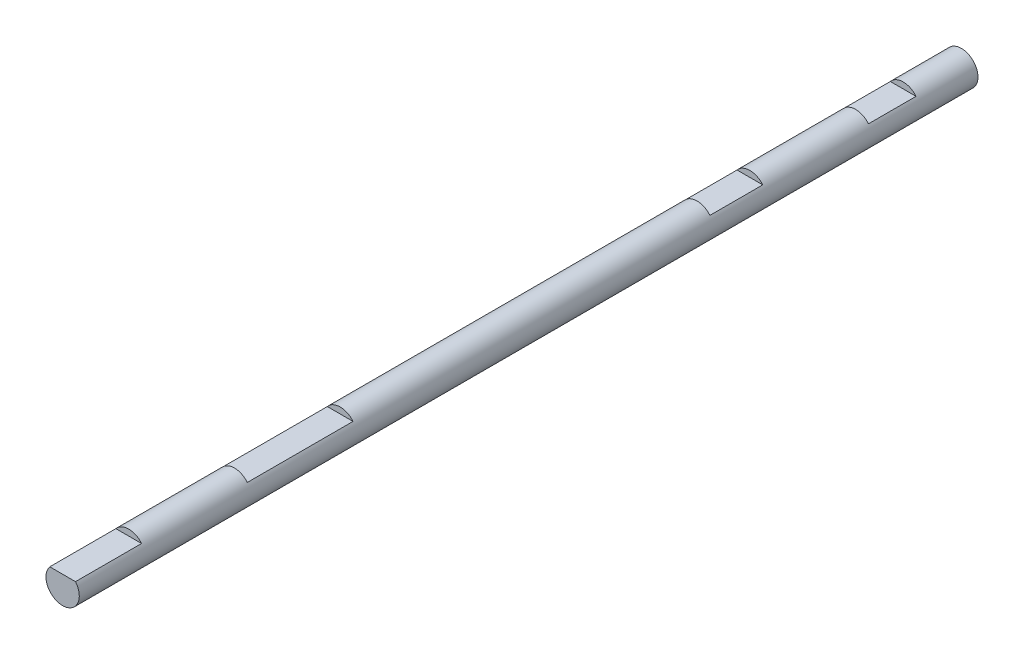
ISO-10303-21;
HEADER;
FILE_DESCRIPTION(('STEP AP214'),'2;1');
FILE_NAME('part.step','',(''),(''),'','','');
FILE_SCHEMA(('AUTOMOTIVE_DESIGN { 1 0 10303 214 1 1 1 1 }'));
ENDSEC;
DATA;
#1=APPLICATION_CONTEXT('core data for automotive mechanical design processes');
#2=APPLICATION_PROTOCOL_DEFINITION('international standard','automotive_design',2000,#1);
#3=PRODUCT_CONTEXT('',#1,'mechanical');
#4=PRODUCT('Part','Part','',(#3));
#5=PRODUCT_RELATED_PRODUCT_CATEGORY('part','',(#4));
#6=PRODUCT_DEFINITION_FORMATION('','',#4);
#7=PRODUCT_DEFINITION_CONTEXT('part definition',#1,'design');
#8=PRODUCT_DEFINITION('design','',#6,#7);
#9=PRODUCT_DEFINITION_SHAPE('','',#8);
#10=(LENGTH_UNIT() NAMED_UNIT(*) SI_UNIT(.MILLI.,.METRE.));
#11=(NAMED_UNIT(*) PLANE_ANGLE_UNIT() SI_UNIT($,.RADIAN.));
#12=(NAMED_UNIT(*) SI_UNIT($,.STERADIAN.) SOLID_ANGLE_UNIT());
#13=UNCERTAINTY_MEASURE_WITH_UNIT(LENGTH_MEASURE(1.E-05),#10,'distance_accuracy_value','');
#14=(GEOMETRIC_REPRESENTATION_CONTEXT(3) GLOBAL_UNCERTAINTY_ASSIGNED_CONTEXT((#13)) GLOBAL_UNIT_ASSIGNED_CONTEXT((#10,
#11,#12)) REPRESENTATION_CONTEXT('',''));
#15=CARTESIAN_POINT('',(0.,0.,0.));
#16=DIRECTION('',(0.,0.,1.));
#17=DIRECTION('',(1.,0.,0.));
#18=AXIS2_PLACEMENT_3D('',#15,#16,#17);
#19=CARTESIAN_POINT('',(0.,0.,215.9));
#20=DIRECTION('',(0.,0.,-1.));
#21=DIRECTION('',(-1.,0.,0.));
#22=AXIS2_PLACEMENT_3D('',#19,#20,#21);
#23=CYLINDRICAL_SURFACE('',#22,4.);
#24=DIRECTION('',(0.,0.,-1.));
#25=VECTOR('',#24,1.);
#26=CARTESIAN_POINT('',(3.09004854330804,2.53999999999997,215.9));
#27=LINE('',#26,#25);
#28=CARTESIAN_POINT('',(3.09004854330804,2.53999999999997,13.97));
#29=VERTEX_POINT('',#28);
#30=CARTESIAN_POINT('',(3.09004854330804,2.53999999999997,25.4));
#31=VERTEX_POINT('',#30);
#32=EDGE_CURVE('E159',#29,#31,#27,.F.);
#33=ORIENTED_EDGE('',*,*,#32,.T.);
#34=CARTESIAN_POINT('',(0.,0.,25.4));
#35=DIRECTION('',(0.,0.,1.));
#36=DIRECTION('',(1.,0.,0.));
#37=AXIS2_PLACEMENT_3D('',#34,#35,#36);
#38=CIRCLE('',#37,4.);
#39=CARTESIAN_POINT('',(-3.09004854330804,2.53999999999997,25.4));
#40=VERTEX_POINT('',#39);
#41=EDGE_CURVE('E11',#31,#40,#38,.T.);
#42=ORIENTED_EDGE('',*,*,#41,.T.);
#43=DIRECTION('',(0.,0.,-1.));
#44=VECTOR('',#43,1.);
#45=CARTESIAN_POINT('',(-3.09004854330804,2.53999999999997,215.9));
#46=LINE('',#45,#44);
#47=CARTESIAN_POINT('',(-3.09004854330804,2.53999999999997,13.97));
#48=VERTEX_POINT('',#47);
#49=EDGE_CURVE('E53',#40,#48,#46,.T.);
#50=ORIENTED_EDGE('',*,*,#49,.T.);
#51=CARTESIAN_POINT('',(0.,0.,13.97));
#52=DIRECTION('',(0.,0.,1.));
#53=DIRECTION('',(1.,0.,0.));
#54=AXIS2_PLACEMENT_3D('',#51,#52,#53);
#55=CIRCLE('',#54,4.);
#56=EDGE_CURVE('E157',#29,#48,#55,.T.);
#57=ORIENTED_EDGE('',*,*,#56,.F.);
#58=EDGE_LOOP('',(#33,#42,#50,#57));
#59=FACE_BOUND('',#58,.T.);
#60=DIRECTION('',(0.,0.,-1.));
#61=VECTOR('',#60,1.);
#62=CARTESIAN_POINT('',(3.09004854330804,2.53999999999997,215.9));
#63=LINE('',#62,#61);
#64=CARTESIAN_POINT('',(3.09004854330804,2.53999999999997,149.225));
#65=VERTEX_POINT('',#64);
#66=CARTESIAN_POINT('',(3.09004854330804,2.53999999999997,174.625));
#67=VERTEX_POINT('',#66);
#68=EDGE_CURVE('E153',#65,#67,#63,.F.);
#69=ORIENTED_EDGE('',*,*,#68,.T.);
#70=CARTESIAN_POINT('',(0.,0.,174.625));
#71=DIRECTION('',(0.,0.,1.));
#72=DIRECTION('',(1.,0.,0.));
#73=AXIS2_PLACEMENT_3D('',#70,#71,#72);
#74=CIRCLE('',#73,4.);
#75=CARTESIAN_POINT('',(-3.09004854330804,2.53999999999997,174.625));
#76=VERTEX_POINT('',#75);
#77=EDGE_CURVE('E145',#67,#76,#74,.T.);
#78=ORIENTED_EDGE('',*,*,#77,.T.);
#79=DIRECTION('',(0.,0.,-1.));
#80=VECTOR('',#79,1.);
#81=CARTESIAN_POINT('',(-3.09004854330804,2.53999999999997,215.9));
#82=LINE('',#81,#80);
#83=CARTESIAN_POINT('',(-3.09004854330804,2.53999999999997,149.225));
#84=VERTEX_POINT('',#83);
#85=EDGE_CURVE('E148',#76,#84,#82,.T.);
#86=ORIENTED_EDGE('',*,*,#85,.T.);
#87=CARTESIAN_POINT('',(0.,0.,149.225));
#88=DIRECTION('',(0.,0.,1.));
#89=DIRECTION('',(1.,0.,0.));
#90=AXIS2_PLACEMENT_3D('',#87,#88,#89);
#91=CIRCLE('',#90,4.);
#92=EDGE_CURVE('E151',#65,#84,#91,.T.);
#93=ORIENTED_EDGE('',*,*,#92,.F.);
#94=EDGE_LOOP('',(#69,#78,#86,#93));
#95=FACE_BOUND('',#94,.T.);
#96=CARTESIAN_POINT('',(0.,0.,0.));
#97=DIRECTION('',(0.,0.,1.));
#98=DIRECTION('',(1.,0.,0.));
#99=AXIS2_PLACEMENT_3D('',#96,#97,#98);
#100=CIRCLE('',#99,4.);
#101=CARTESIAN_POINT('',(4.,0.,0.));
#102=VERTEX_POINT('',#101);
#103=EDGE_CURVE('E129',#102,#102,#100,.T.);
#104=ORIENTED_EDGE('',*,*,#103,.T.);
#105=EDGE_LOOP('',(#104));
#106=FACE_BOUND('',#105,.T.);
#107=DIRECTION('',(0.,0.,-1.));
#108=VECTOR('',#107,1.);
#109=CARTESIAN_POINT('',(3.09004854330804,2.53999999999997,215.9));
#110=LINE('',#109,#108);
#111=CARTESIAN_POINT('',(3.09004854330804,2.53999999999997,50.8));
#112=VERTEX_POINT('',#111);
#113=CARTESIAN_POINT('',(3.09004854330804,2.53999999999997,63.5));
#114=VERTEX_POINT('',#113);
#115=EDGE_CURVE('E142',#112,#114,#110,.F.);
#116=ORIENTED_EDGE('',*,*,#115,.T.);
#117=CARTESIAN_POINT('',(0.,0.,63.5));
#118=DIRECTION('',(0.,0.,1.));
#119=DIRECTION('',(1.,0.,0.));
#120=AXIS2_PLACEMENT_3D('',#117,#118,#119);
#121=CIRCLE('',#120,4.);
#122=CARTESIAN_POINT('',(-3.09004854330804,2.53999999999997,63.5));
#123=VERTEX_POINT('',#122);
#124=EDGE_CURVE('E121',#114,#123,#121,.T.);
#125=ORIENTED_EDGE('',*,*,#124,.T.);
#126=DIRECTION('',(0.,0.,-1.));
#127=VECTOR('',#126,1.);
#128=CARTESIAN_POINT('',(-3.09004854330804,2.53999999999997,215.9));
#129=LINE('',#128,#127);
#130=CARTESIAN_POINT('',(-3.09004854330804,2.53999999999997,50.8));
#131=VERTEX_POINT('',#130);
#132=EDGE_CURVE('E137',#123,#131,#129,.T.);
#133=ORIENTED_EDGE('',*,*,#132,.T.);
#134=CARTESIAN_POINT('',(0.,0.,50.8));
#135=DIRECTION('',(0.,0.,1.));
#136=DIRECTION('',(1.,0.,0.));
#137=AXIS2_PLACEMENT_3D('',#134,#135,#136);
#138=CIRCLE('',#137,4.);
#139=EDGE_CURVE('E140',#112,#131,#138,.T.);
#140=ORIENTED_EDGE('',*,*,#139,.F.);
#141=EDGE_LOOP('',(#116,#125,#133,#140));
#142=FACE_BOUND('',#141,.T.);
#143=CARTESIAN_POINT('',(0.,0.,200.025));
#144=DIRECTION('',(0.,0.,1.));
#145=DIRECTION('',(1.,0.,0.));
#146=AXIS2_PLACEMENT_3D('',#143,#144,#145);
#147=CIRCLE('',#146,4.);
#148=CARTESIAN_POINT('',(3.09004854330813,2.53999999999997,200.025));
#149=VERTEX_POINT('',#148);
#150=CARTESIAN_POINT('',(-3.09004854330813,2.53999999999997,200.025));
#151=VERTEX_POINT('',#150);
#152=EDGE_CURVE('E125',#149,#151,#147,.T.);
#153=ORIENTED_EDGE('',*,*,#152,.F.);
#154=DIRECTION('',(0.,0.,-1.));
#155=VECTOR('',#154,1.);
#156=CARTESIAN_POINT('',(3.09004854330813,2.53999999999986,215.9));
#157=LINE('',#156,#155);
#158=CARTESIAN_POINT('',(3.09004854330813,2.53999999999986,215.9));
#159=VERTEX_POINT('',#158);
#160=EDGE_CURVE('E114',#149,#159,#157,.F.);
#161=ORIENTED_EDGE('',*,*,#160,.T.);
#162=CARTESIAN_POINT('',(0.,0.,215.9));
#163=DIRECTION('',(0.,0.,1.));
#164=DIRECTION('',(1.,0.,0.));
#165=AXIS2_PLACEMENT_3D('',#162,#163,#164);
#166=CIRCLE('',#165,4.);
#167=CARTESIAN_POINT('',(-3.09004854330813,2.53999999999986,215.9));
#168=VERTEX_POINT('',#167);
#169=EDGE_CURVE('E122',#168,#159,#166,.T.);
#170=ORIENTED_EDGE('',*,*,#169,.F.);
#171=DIRECTION('',(0.,0.,-1.));
#172=VECTOR('',#171,1.);
#173=CARTESIAN_POINT('',(-3.09004854330813,2.53999999999986,215.9));
#174=LINE('',#173,#172);
#175=EDGE_CURVE('E117',#168,#151,#174,.T.);
#176=ORIENTED_EDGE('',*,*,#175,.T.);
#177=EDGE_LOOP('',(#153,#161,#170,#176));
#178=FACE_BOUND('',#177,.T.);
#179=ADVANCED_FACE('F46',(#59,#95,#106,#142,#178),#23,.T.);
#180=CARTESIAN_POINT('',(0.,0.,215.9));
#181=DIRECTION('',(0.,0.,1.));
#182=DIRECTION('',(1.,0.,0.));
#183=AXIS2_PLACEMENT_3D('',#180,#181,#182);
#184=PLANE('',#183);
#185=DIRECTION('',(1.,0.,0.));
#186=VECTOR('',#185,1.);
#187=CARTESIAN_POINT('',(0.,2.53999999999986,215.9));
#188=LINE('',#187,#186);
#189=EDGE_CURVE('E110',#168,#159,#188,.T.);
#190=ORIENTED_EDGE('',*,*,#189,.F.);
#191=ORIENTED_EDGE('',*,*,#169,.T.);
#192=EDGE_LOOP('',(#190,#191));
#193=FACE_BOUND('',#192,.T.);
#194=ADVANCED_FACE('F128',(#193),#184,.T.);
#195=CARTESIAN_POINT('',(0.,0.,0.));
#196=DIRECTION('',(0.,0.,1.));
#197=DIRECTION('',(1.,0.,0.));
#198=AXIS2_PLACEMENT_3D('',#195,#196,#197);
#199=PLANE('',#198);
#200=ORIENTED_EDGE('',*,*,#103,.F.);
#201=EDGE_LOOP('',(#200));
#202=FACE_BOUND('',#201,.T.);
#203=ADVANCED_FACE('F193',(#202),#199,.F.);
#204=CARTESIAN_POINT('',(-6.35,0.,200.025));
#205=DIRECTION('',(0.,0.,1.));
#206=DIRECTION('',(1.,0.,0.));
#207=AXIS2_PLACEMENT_3D('',#204,#205,#206);
#208=PLANE('',#207);
#209=DIRECTION('',(1.,0.,0.));
#210=VECTOR('',#209,1.);
#211=CARTESIAN_POINT('',(-6.35,2.53999999999997,200.025));
#212=LINE('',#211,#210);
#213=EDGE_CURVE('E176',#151,#149,#212,.T.);
#214=ORIENTED_EDGE('',*,*,#213,.T.);
#215=ORIENTED_EDGE('',*,*,#152,.T.);
#216=EDGE_LOOP('',(#214,#215));
#217=FACE_BOUND('',#216,.T.);
#218=ADVANCED_FACE('F191',(#217),#208,.T.);
#219=CARTESIAN_POINT('',(-6.35,2.54000000000139,0.));
#220=DIRECTION('',(0.,-1.,0.));
#221=DIRECTION('',(0.,0.,-1.));
#222=AXIS2_PLACEMENT_3D('',#219,#220,#221);
#223=PLANE('',#222);
#224=ORIENTED_EDGE('',*,*,#189,.T.);
#225=ORIENTED_EDGE('',*,*,#160,.F.);
#226=ORIENTED_EDGE('',*,*,#213,.F.);
#227=ORIENTED_EDGE('',*,*,#175,.F.);
#228=EDGE_LOOP('',(#224,#225,#226,#227));
#229=FACE_BOUND('',#228,.T.);
#230=ADVANCED_FACE('F112',(#229),#223,.F.);
#231=CARTESIAN_POINT('',(-6.35,0.,50.8));
#232=DIRECTION('',(0.,0.,1.));
#233=DIRECTION('',(1.,0.,0.));
#234=AXIS2_PLACEMENT_3D('',#231,#232,#233);
#235=PLANE('',#234);
#236=DIRECTION('',(1.,0.,0.));
#237=VECTOR('',#236,1.);
#238=CARTESIAN_POINT('',(-6.35,2.53999999999997,50.8));
#239=LINE('',#238,#237);
#240=EDGE_CURVE('E126',#131,#112,#239,.T.);
#241=ORIENTED_EDGE('',*,*,#240,.T.);
#242=ORIENTED_EDGE('',*,*,#139,.T.);
#243=EDGE_LOOP('',(#241,#242));
#244=FACE_BOUND('',#243,.T.);
#245=ADVANCED_FACE('F199',(#244),#235,.T.);
#246=CARTESIAN_POINT('',(-6.35,2.53999999999997,0.));
#247=DIRECTION('',(0.,-1.,0.));
#248=DIRECTION('',(0.,0.,-1.));
#249=AXIS2_PLACEMENT_3D('',#246,#247,#248);
#250=PLANE('',#249);
#251=DIRECTION('',(1.,0.,0.));
#252=VECTOR('',#251,1.);
#253=CARTESIAN_POINT('',(-6.35,2.53999999999997,63.5));
#254=LINE('',#253,#252);
#255=EDGE_CURVE('E66',#123,#114,#254,.T.);
#256=ORIENTED_EDGE('',*,*,#255,.T.);
#257=ORIENTED_EDGE('',*,*,#115,.F.);
#258=ORIENTED_EDGE('',*,*,#240,.F.);
#259=ORIENTED_EDGE('',*,*,#132,.F.);
#260=EDGE_LOOP('',(#256,#257,#258,#259));
#261=FACE_BOUND('',#260,.T.);
#262=ADVANCED_FACE('F214',(#261),#250,.F.);
#263=CARTESIAN_POINT('',(-6.35,0.,63.5));
#264=DIRECTION('',(0.,0.,1.));
#265=DIRECTION('',(1.,0.,0.));
#266=AXIS2_PLACEMENT_3D('',#263,#264,#265);
#267=PLANE('',#266);
#268=ORIENTED_EDGE('',*,*,#255,.F.);
#269=ORIENTED_EDGE('',*,*,#124,.F.);
#270=EDGE_LOOP('',(#268,#269));
#271=FACE_BOUND('',#270,.T.);
#272=ADVANCED_FACE('F216',(#271),#267,.F.);
#273=CARTESIAN_POINT('',(-6.35,0.,149.225));
#274=DIRECTION('',(0.,0.,1.));
#275=DIRECTION('',(1.,0.,0.));
#276=AXIS2_PLACEMENT_3D('',#273,#274,#275);
#277=PLANE('',#276);
#278=DIRECTION('',(1.,0.,0.));
#279=VECTOR('',#278,1.);
#280=CARTESIAN_POINT('',(-6.35,2.53999999999997,149.225));
#281=LINE('',#280,#279);
#282=EDGE_CURVE('E184',#84,#65,#281,.T.);
#283=ORIENTED_EDGE('',*,*,#282,.T.);
#284=ORIENTED_EDGE('',*,*,#92,.T.);
#285=EDGE_LOOP('',(#283,#284));
#286=FACE_BOUND('',#285,.T.);
#287=ADVANCED_FACE('F219',(#286),#277,.T.);
#288=CARTESIAN_POINT('',(-6.35,2.53999999999997,0.));
#289=DIRECTION('',(0.,-1.,0.));
#290=DIRECTION('',(0.,0.,-1.));
#291=AXIS2_PLACEMENT_3D('',#288,#289,#290);
#292=PLANE('',#291);
#293=DIRECTION('',(1.,0.,0.));
#294=VECTOR('',#293,1.);
#295=CARTESIAN_POINT('',(-6.35,2.53999999999997,174.625));
#296=LINE('',#295,#294);
#297=EDGE_CURVE('E59',#76,#67,#296,.T.);
#298=ORIENTED_EDGE('',*,*,#297,.T.);
#299=ORIENTED_EDGE('',*,*,#68,.F.);
#300=ORIENTED_EDGE('',*,*,#282,.F.);
#301=ORIENTED_EDGE('',*,*,#85,.F.);
#302=EDGE_LOOP('',(#298,#299,#300,#301));
#303=FACE_BOUND('',#302,.T.);
#304=ADVANCED_FACE('F233',(#303),#292,.F.);
#305=CARTESIAN_POINT('',(-6.35,0.,174.625));
#306=DIRECTION('',(0.,0.,1.));
#307=DIRECTION('',(1.,0.,0.));
#308=AXIS2_PLACEMENT_3D('',#305,#306,#307);
#309=PLANE('',#308);
#310=ORIENTED_EDGE('',*,*,#297,.F.);
#311=ORIENTED_EDGE('',*,*,#77,.F.);
#312=EDGE_LOOP('',(#310,#311));
#313=FACE_BOUND('',#312,.T.);
#314=ADVANCED_FACE('F229',(#313),#309,.F.);
#315=CARTESIAN_POINT('',(-6.35,2.53999999999997,25.4));
#316=DIRECTION('',(0.,-1.,0.));
#317=DIRECTION('',(0.,0.,-1.));
#318=AXIS2_PLACEMENT_3D('',#315,#316,#317);
#319=PLANE('',#318);
#320=DIRECTION('',(1.,0.,0.));
#321=VECTOR('',#320,1.);
#322=CARTESIAN_POINT('',(-6.35,2.53999999999997,25.4));
#323=LINE('',#322,#321);
#324=EDGE_CURVE('E170',#40,#31,#323,.T.);
#325=ORIENTED_EDGE('',*,*,#324,.T.);
#326=ORIENTED_EDGE('',*,*,#32,.F.);
#327=DIRECTION('',(1.,0.,0.));
#328=VECTOR('',#327,1.);
#329=CARTESIAN_POINT('',(-6.35,2.53999999999997,13.97));
#330=LINE('',#329,#328);
#331=EDGE_CURVE('E172',#48,#29,#330,.T.);
#332=ORIENTED_EDGE('',*,*,#331,.F.);
#333=ORIENTED_EDGE('',*,*,#49,.F.);
#334=EDGE_LOOP('',(#325,#326,#332,#333));
#335=FACE_BOUND('',#334,.T.);
#336=ADVANCED_FACE('F169',(#335),#319,.F.);
#337=CARTESIAN_POINT('',(-6.35,4.,25.4));
#338=DIRECTION('',(0.,0.,1.));
#339=DIRECTION('',(1.,0.,0.));
#340=AXIS2_PLACEMENT_3D('',#337,#338,#339);
#341=PLANE('',#340);
#342=ORIENTED_EDGE('',*,*,#324,.F.);
#343=ORIENTED_EDGE('',*,*,#41,.F.);
#344=EDGE_LOOP('',(#342,#343));
#345=FACE_BOUND('',#344,.T.);
#346=ADVANCED_FACE('F174',(#345),#341,.F.);
#347=CARTESIAN_POINT('',(-6.35,4.00000000000001,13.97));
#348=DIRECTION('',(0.,0.,1.));
#349=DIRECTION('',(1.,0.,0.));
#350=AXIS2_PLACEMENT_3D('',#347,#348,#349);
#351=PLANE('',#350);
#352=ORIENTED_EDGE('',*,*,#331,.T.);
#353=ORIENTED_EDGE('',*,*,#56,.T.);
#354=EDGE_LOOP('',(#352,#353));
#355=FACE_BOUND('',#354,.T.);
#356=ADVANCED_FACE('F224',(#355),#351,.T.);
#357=CLOSED_SHELL('',(#179,#194,#203,#218,#230,#245,#262,#272,#287,#304,#314,#336,#346,#356));
#358=MANIFOLD_SOLID_BREP('B2',#357);
#359=ADVANCED_BREP_SHAPE_REPRESENTATION('',(#18,#358),#14);
#360=SHAPE_DEFINITION_REPRESENTATION(#9,#359);
ENDSEC;
END-ISO-10303-21;
